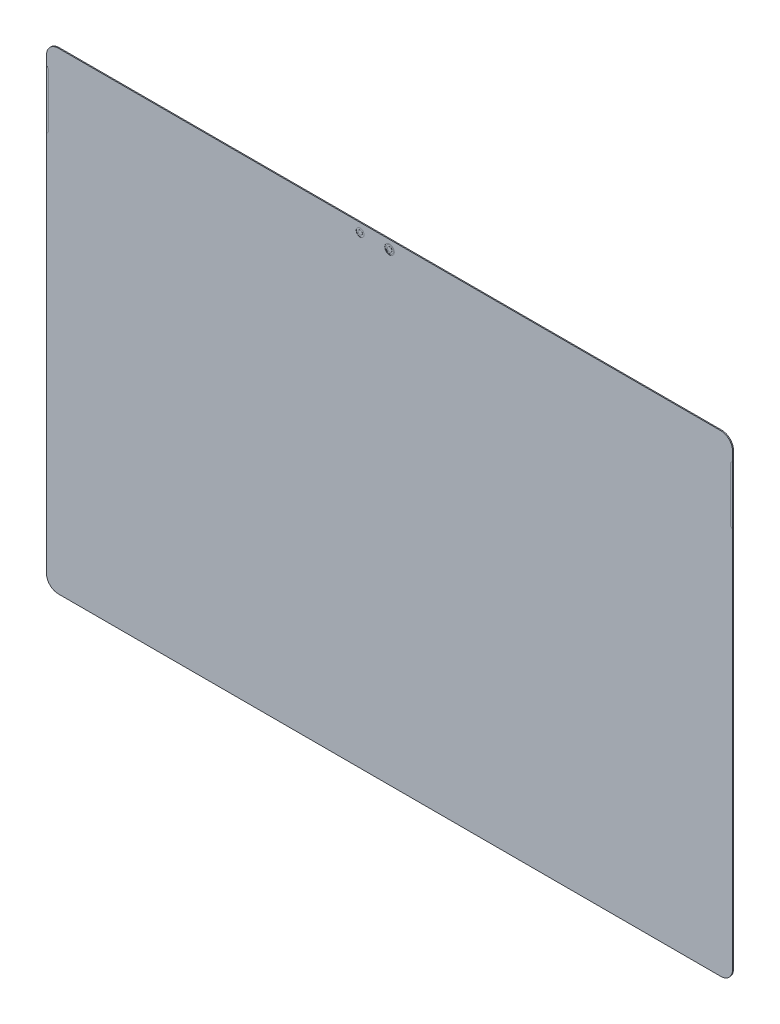
ISO-10303-21;
HEADER;
FILE_DESCRIPTION(('STEP AP214'),'2;1');
FILE_NAME('part.step','',(''),(''),'','','');
FILE_SCHEMA(('AUTOMOTIVE_DESIGN { 1 0 10303 214 1 1 1 1 }'));
ENDSEC;
DATA;
#1=APPLICATION_CONTEXT('core data for automotive mechanical design processes');
#2=APPLICATION_PROTOCOL_DEFINITION('international standard','automotive_design',2000,#1);
#3=PRODUCT_CONTEXT('',#1,'mechanical');
#4=PRODUCT('Part','Part','',(#3));
#5=PRODUCT_RELATED_PRODUCT_CATEGORY('part','',(#4));
#6=PRODUCT_DEFINITION_FORMATION('','',#4);
#7=PRODUCT_DEFINITION_CONTEXT('part definition',#1,'design');
#8=PRODUCT_DEFINITION('design','',#6,#7);
#9=PRODUCT_DEFINITION_SHAPE('','',#8);
#10=(LENGTH_UNIT() NAMED_UNIT(*) SI_UNIT(.MILLI.,.METRE.));
#11=(NAMED_UNIT(*) PLANE_ANGLE_UNIT() SI_UNIT($,.RADIAN.));
#12=(NAMED_UNIT(*) SI_UNIT($,.STERADIAN.) SOLID_ANGLE_UNIT());
#13=UNCERTAINTY_MEASURE_WITH_UNIT(LENGTH_MEASURE(1.E-05),#10,'distance_accuracy_value','');
#14=(GEOMETRIC_REPRESENTATION_CONTEXT(3) GLOBAL_UNCERTAINTY_ASSIGNED_CONTEXT((#13)) GLOBAL_UNIT_ASSIGNED_CONTEXT((#10,
#11,#12)) REPRESENTATION_CONTEXT('',''));
#15=CARTESIAN_POINT('',(0.,0.,0.));
#16=DIRECTION('',(0.,0.,1.));
#17=DIRECTION('',(1.,0.,0.));
#18=AXIS2_PLACEMENT_3D('',#15,#16,#17);
#19=CARTESIAN_POINT('',(-152.1,-103.1,0.45));
#20=DIRECTION('',(0.,0.,1.));
#21=DIRECTION('',(1.,0.,0.));
#22=AXIS2_PLACEMENT_3D('',#19,#20,#21);
#23=PLANE('',#22);
#24=CARTESIAN_POINT('',(0.,104.5,0.45));
#25=DIRECTION('',(0.,0.,1.));
#26=DIRECTION('',(1.,0.,0.));
#27=AXIS2_PLACEMENT_3D('',#24,#25,#26);
#28=CIRCLE('',#27,2.2);
#29=CARTESIAN_POINT('',(2.19999999999997,104.5,0.45));
#30=VERTEX_POINT('',#29);
#31=EDGE_CURVE('E271',#30,#30,#28,.T.);
#32=ORIENTED_EDGE('',*,*,#31,.F.);
#33=EDGE_LOOP('',(#32));
#34=FACE_BOUND('',#33,.T.);
#35=CARTESIAN_POINT('',(-13.5,104.5,0.45));
#36=DIRECTION('',(0.,0.,1.));
#37=DIRECTION('',(1.,0.,0.));
#38=AXIS2_PLACEMENT_3D('',#35,#36,#37);
#39=CIRCLE('',#38,1.79999999999999);
#40=CARTESIAN_POINT('',(-11.7,104.5,0.45));
#41=VERTEX_POINT('',#40);
#42=EDGE_CURVE('E264',#41,#41,#39,.T.);
#43=ORIENTED_EDGE('',*,*,#42,.F.);
#44=EDGE_LOOP('',(#43));
#45=FACE_BOUND('',#44,.T.);
#46=DIRECTION('',(0.,-1.,0.));
#47=VECTOR('',#46,1.);
#48=CARTESIAN_POINT('',(-157.5,103.1,0.45));
#49=LINE('',#48,#47);
#50=CARTESIAN_POINT('',(-157.5,103.1,0.45));
#51=VERTEX_POINT('',#50);
#52=CARTESIAN_POINT('',(-157.5,98.9448186316806,0.45));
#53=VERTEX_POINT('',#52);
#54=EDGE_CURVE('E297',#51,#53,#49,.T.);
#55=ORIENTED_EDGE('',*,*,#54,.T.);
#56=DIRECTION('',(-0.707106781186568,0.707106781186527,0.));
#57=VECTOR('',#56,1.);
#58=CARTESIAN_POINT('',(-156.792893218813,98.237711850494,0.45));
#59=LINE('',#58,#57);
#60=CARTESIAN_POINT('',(-156.792893218813,98.237711850494,0.45));
#61=VERTEX_POINT('',#60);
#62=EDGE_CURVE('E434',#61,#53,#59,.T.);
#63=ORIENTED_EDGE('',*,*,#62,.F.);
#64=CARTESIAN_POINT('',(-157.5,97.5306050693075,0.45));
#65=DIRECTION('',(0.,0.,1.));
#66=DIRECTION('',(1.,0.,0.));
#67=AXIS2_PLACEMENT_3D('',#64,#65,#66);
#68=CIRCLE('',#67,1.);
#69=CARTESIAN_POINT('',(-156.5,97.5306050693075,0.45));
#70=VERTEX_POINT('',#69);
#71=EDGE_CURVE('E198',#70,#61,#68,.T.);
#72=ORIENTED_EDGE('',*,*,#71,.F.);
#73=DIRECTION('',(0.,1.,0.));
#74=VECTOR('',#73,1.);
#75=CARTESIAN_POINT('',(-156.5,73.3590321940537,0.45));
#76=LINE('',#75,#74);
#77=CARTESIAN_POINT('',(-156.5,73.3590321940537,0.45));
#78=VERTEX_POINT('',#77);
#79=EDGE_CURVE('E194',#78,#70,#76,.T.);
#80=ORIENTED_EDGE('',*,*,#79,.F.);
#81=CARTESIAN_POINT('',(-157.5,73.3590321940537,0.45));
#82=DIRECTION('',(0.,0.,1.));
#83=DIRECTION('',(1.,0.,0.));
#84=AXIS2_PLACEMENT_3D('',#81,#82,#83);
#85=CIRCLE('',#84,1.);
#86=CARTESIAN_POINT('',(-156.792893218813,72.6519254128671,0.45));
#87=VERTEX_POINT('',#86);
#88=EDGE_CURVE('E438',#87,#78,#85,.T.);
#89=ORIENTED_EDGE('',*,*,#88,.F.);
#90=DIRECTION('',(0.707106781186554,0.707106781186541,0.));
#91=VECTOR('',#90,1.);
#92=CARTESIAN_POINT('',(-157.5,71.9448186316806,0.45));
#93=LINE('',#92,#91);
#94=CARTESIAN_POINT('',(-157.5,71.9448186316806,0.45));
#95=VERTEX_POINT('',#94);
#96=EDGE_CURVE('E436',#95,#87,#93,.T.);
#97=ORIENTED_EDGE('',*,*,#96,.F.);
#98=CARTESIAN_POINT('',(-157.5,-103.1,0.45));
#99=VERTEX_POINT('',#98);
#100=EDGE_CURVE('E296',#95,#99,#49,.T.);
#101=ORIENTED_EDGE('',*,*,#100,.T.);
#102=CARTESIAN_POINT('',(-152.1,-103.1,0.45));
#103=DIRECTION('',(0.,0.,1.));
#104=DIRECTION('',(1.,0.,0.));
#105=AXIS2_PLACEMENT_3D('',#102,#103,#104);
#106=CIRCLE('',#105,5.4);
#107=CARTESIAN_POINT('',(-152.1,-108.5,0.45));
#108=VERTEX_POINT('',#107);
#109=EDGE_CURVE('E279',#99,#108,#106,.T.);
#110=ORIENTED_EDGE('',*,*,#109,.T.);
#111=DIRECTION('',(1.,0.,0.));
#112=VECTOR('',#111,1.);
#113=CARTESIAN_POINT('',(-152.1,-108.5,0.45));
#114=LINE('',#113,#112);
#115=CARTESIAN_POINT('',(152.1,-108.5,0.45));
#116=VERTEX_POINT('',#115);
#117=EDGE_CURVE('E282',#108,#116,#114,.T.);
#118=ORIENTED_EDGE('',*,*,#117,.T.);
#119=CARTESIAN_POINT('',(152.1,-103.1,0.45));
#120=DIRECTION('',(0.,0.,1.));
#121=DIRECTION('',(1.,0.,0.));
#122=AXIS2_PLACEMENT_3D('',#119,#120,#121);
#123=CIRCLE('',#122,5.4);
#124=CARTESIAN_POINT('',(157.5,-103.1,0.45));
#125=VERTEX_POINT('',#124);
#126=EDGE_CURVE('E285',#116,#125,#123,.T.);
#127=ORIENTED_EDGE('',*,*,#126,.T.);
#128=DIRECTION('',(0.,1.,0.));
#129=VECTOR('',#128,1.);
#130=CARTESIAN_POINT('',(157.5,-103.1,0.45));
#131=LINE('',#130,#129);
#132=CARTESIAN_POINT('',(157.5,71.9448186316806,0.45));
#133=VERTEX_POINT('',#132);
#134=EDGE_CURVE('E288',#125,#133,#131,.T.);
#135=ORIENTED_EDGE('',*,*,#134,.T.);
#136=DIRECTION('',(0.707106781186554,-0.707106781186541,0.));
#137=VECTOR('',#136,1.);
#138=CARTESIAN_POINT('',(157.5,71.9448186316806,0.45));
#139=LINE('',#138,#137);
#140=CARTESIAN_POINT('',(156.792893218813,72.6519254128671,0.45));
#141=VERTEX_POINT('',#140);
#142=EDGE_CURVE('E61',#141,#133,#139,.T.);
#143=ORIENTED_EDGE('',*,*,#142,.F.);
#144=CARTESIAN_POINT('',(157.5,73.3590321940537,0.45));
#145=DIRECTION('',(0.,0.,1.));
#146=DIRECTION('',(-1.,0.,0.));
#147=AXIS2_PLACEMENT_3D('',#144,#145,#146);
#148=CIRCLE('',#147,1.);
#149=CARTESIAN_POINT('',(156.5,73.3590321940537,0.45));
#150=VERTEX_POINT('',#149);
#151=EDGE_CURVE('E228',#150,#141,#148,.T.);
#152=ORIENTED_EDGE('',*,*,#151,.F.);
#153=DIRECTION('',(0.,-1.,0.));
#154=VECTOR('',#153,1.);
#155=CARTESIAN_POINT('',(156.5,73.3590321940537,0.45));
#156=LINE('',#155,#154);
#157=CARTESIAN_POINT('',(156.5,97.5306050693075,0.45));
#158=VERTEX_POINT('',#157);
#159=EDGE_CURVE('E225',#158,#150,#156,.T.);
#160=ORIENTED_EDGE('',*,*,#159,.F.);
#161=CARTESIAN_POINT('',(157.5,97.5306050693075,0.45));
#162=DIRECTION('',(0.,0.,1.));
#163=DIRECTION('',(-1.,0.,0.));
#164=AXIS2_PLACEMENT_3D('',#161,#162,#163);
#165=CIRCLE('',#164,1.);
#166=CARTESIAN_POINT('',(156.792893218813,98.237711850494,0.45));
#167=VERTEX_POINT('',#166);
#168=EDGE_CURVE('E203',#167,#158,#165,.T.);
#169=ORIENTED_EDGE('',*,*,#168,.F.);
#170=DIRECTION('',(-0.707106781186568,-0.707106781186527,0.));
#171=VECTOR('',#170,1.);
#172=CARTESIAN_POINT('',(156.792893218813,98.237711850494,0.45));
#173=LINE('',#172,#171);
#174=CARTESIAN_POINT('',(157.5,98.9448186316805,0.45));
#175=VERTEX_POINT('',#174);
#176=EDGE_CURVE('E200',#175,#167,#173,.T.);
#177=ORIENTED_EDGE('',*,*,#176,.F.);
#178=CARTESIAN_POINT('',(157.5,103.1,0.45));
#179=VERTEX_POINT('',#178);
#180=EDGE_CURVE('E287',#175,#179,#131,.T.);
#181=ORIENTED_EDGE('',*,*,#180,.T.);
#182=CARTESIAN_POINT('',(152.1,103.1,0.45));
#183=DIRECTION('',(0.,0.,1.));
#184=DIRECTION('',(1.,0.,0.));
#185=AXIS2_PLACEMENT_3D('',#182,#183,#184);
#186=CIRCLE('',#185,5.39999999999999);
#187=CARTESIAN_POINT('',(152.1,108.5,0.45));
#188=VERTEX_POINT('',#187);
#189=EDGE_CURVE('E290',#179,#188,#186,.T.);
#190=ORIENTED_EDGE('',*,*,#189,.T.);
#191=DIRECTION('',(-1.,0.,0.));
#192=VECTOR('',#191,1.);
#193=CARTESIAN_POINT('',(152.1,108.5,0.45));
#194=LINE('',#193,#192);
#195=CARTESIAN_POINT('',(-152.1,108.5,0.45));
#196=VERTEX_POINT('',#195);
#197=EDGE_CURVE('E292',#188,#196,#194,.T.);
#198=ORIENTED_EDGE('',*,*,#197,.T.);
#199=CARTESIAN_POINT('',(-152.1,103.1,0.45));
#200=DIRECTION('',(0.,0.,1.));
#201=DIRECTION('',(1.,0.,0.));
#202=AXIS2_PLACEMENT_3D('',#199,#200,#201);
#203=CIRCLE('',#202,5.4);
#204=EDGE_CURVE('E294',#196,#51,#203,.T.);
#205=ORIENTED_EDGE('',*,*,#204,.T.);
#206=EDGE_LOOP('',(#55,#63,#72,#80,#89,#97,#101,#110,#118,#127,#135,#143,#152,#160,#169,#177,
#181,#190,#198,#205));
#207=FACE_BOUND('',#206,.T.);
#208=ADVANCED_FACE('F38',(#34,#45,#207),#23,.T.);
#209=CARTESIAN_POINT('',(-152.1,-103.1,0.45));
#210=DIRECTION('',(0.,0.,-1.));
#211=DIRECTION('',(-1.,0.,0.));
#212=AXIS2_PLACEMENT_3D('',#209,#210,#211);
#213=CYLINDRICAL_SURFACE('',#212,5.4);
#214=CARTESIAN_POINT('',(-152.1,-103.1,0.));
#215=DIRECTION('',(0.,0.,1.));
#216=DIRECTION('',(1.,0.,0.));
#217=AXIS2_PLACEMENT_3D('',#214,#215,#216);
#218=CIRCLE('',#217,5.4);
#219=CARTESIAN_POINT('',(-157.5,-103.1,0.));
#220=VERTEX_POINT('',#219);
#221=CARTESIAN_POINT('',(-152.1,-108.5,0.));
#222=VERTEX_POINT('',#221);
#223=EDGE_CURVE('E270',#220,#222,#218,.T.);
#224=ORIENTED_EDGE('',*,*,#223,.T.);
#225=DIRECTION('',(0.,0.,-1.));
#226=VECTOR('',#225,1.);
#227=CARTESIAN_POINT('',(-152.1,-108.5,0.45));
#228=LINE('',#227,#226);
#229=EDGE_CURVE('E11',#108,#222,#228,.T.);
#230=ORIENTED_EDGE('',*,*,#229,.F.);
#231=ORIENTED_EDGE('',*,*,#109,.F.);
#232=DIRECTION('',(0.,0.,-1.));
#233=VECTOR('',#232,1.);
#234=CARTESIAN_POINT('',(-157.5,-103.1,0.45));
#235=LINE('',#234,#233);
#236=EDGE_CURVE('E300',#99,#220,#235,.T.);
#237=ORIENTED_EDGE('',*,*,#236,.T.);
#238=EDGE_LOOP('',(#224,#230,#231,#237));
#239=FACE_BOUND('',#238,.T.);
#240=ADVANCED_FACE('F40',(#239),#213,.T.);
#241=CARTESIAN_POINT('',(-152.1,-108.5,0.45));
#242=DIRECTION('',(0.,1.,0.));
#243=DIRECTION('',(0.,0.,1.));
#244=AXIS2_PLACEMENT_3D('',#241,#242,#243);
#245=PLANE('',#244);
#246=DIRECTION('',(1.,0.,0.));
#247=VECTOR('',#246,1.);
#248=CARTESIAN_POINT('',(-152.1,-108.5,0.));
#249=LINE('',#248,#247);
#250=CARTESIAN_POINT('',(152.1,-108.5,0.));
#251=VERTEX_POINT('',#250);
#252=EDGE_CURVE('E303',#222,#251,#249,.T.);
#253=ORIENTED_EDGE('',*,*,#252,.T.);
#254=DIRECTION('',(0.,0.,-1.));
#255=VECTOR('',#254,1.);
#256=CARTESIAN_POINT('',(152.1,-108.5,0.45));
#257=LINE('',#256,#255);
#258=EDGE_CURVE('E46',#116,#251,#257,.T.);
#259=ORIENTED_EDGE('',*,*,#258,.F.);
#260=ORIENTED_EDGE('',*,*,#117,.F.);
#261=ORIENTED_EDGE('',*,*,#229,.T.);
#262=EDGE_LOOP('',(#253,#259,#260,#261));
#263=FACE_BOUND('',#262,.T.);
#264=ADVANCED_FACE('F395',(#263),#245,.F.);
#265=CARTESIAN_POINT('',(152.1,-103.1,0.45));
#266=DIRECTION('',(0.,0.,-1.));
#267=DIRECTION('',(-1.,0.,0.));
#268=AXIS2_PLACEMENT_3D('',#265,#266,#267);
#269=CYLINDRICAL_SURFACE('',#268,5.4);
#270=CARTESIAN_POINT('',(152.1,-103.1,0.));
#271=DIRECTION('',(0.,0.,1.));
#272=DIRECTION('',(1.,0.,0.));
#273=AXIS2_PLACEMENT_3D('',#270,#271,#272);
#274=CIRCLE('',#273,5.4);
#275=CARTESIAN_POINT('',(157.5,-103.1,0.));
#276=VERTEX_POINT('',#275);
#277=EDGE_CURVE('E305',#251,#276,#274,.T.);
#278=ORIENTED_EDGE('',*,*,#277,.T.);
#279=DIRECTION('',(0.,0.,-1.));
#280=VECTOR('',#279,1.);
#281=CARTESIAN_POINT('',(157.5,-103.1,0.45));
#282=LINE('',#281,#280);
#283=EDGE_CURVE('E330',#125,#276,#282,.T.);
#284=ORIENTED_EDGE('',*,*,#283,.F.);
#285=ORIENTED_EDGE('',*,*,#126,.F.);
#286=ORIENTED_EDGE('',*,*,#258,.T.);
#287=EDGE_LOOP('',(#278,#284,#285,#286));
#288=FACE_BOUND('',#287,.T.);
#289=ADVANCED_FACE('F337',(#288),#269,.T.);
#290=CARTESIAN_POINT('',(157.5,-103.1,0.45));
#291=DIRECTION('',(-1.,0.,0.));
#292=DIRECTION('',(0.,-1.,0.));
#293=AXIS2_PLACEMENT_3D('',#290,#291,#292);
#294=PLANE('',#293);
#295=DIRECTION('',(0.,1.,0.));
#296=VECTOR('',#295,1.);
#297=CARTESIAN_POINT('',(157.5,-103.1,0.));
#298=LINE('',#297,#296);
#299=CARTESIAN_POINT('',(157.5,103.1,0.));
#300=VERTEX_POINT('',#299);
#301=EDGE_CURVE('E307',#276,#300,#298,.T.);
#302=ORIENTED_EDGE('',*,*,#301,.T.);
#303=DIRECTION('',(0.,0.,-1.));
#304=VECTOR('',#303,1.);
#305=CARTESIAN_POINT('',(157.5,103.1,0.45));
#306=LINE('',#305,#304);
#307=EDGE_CURVE('E327',#179,#300,#306,.T.);
#308=ORIENTED_EDGE('',*,*,#307,.F.);
#309=ORIENTED_EDGE('',*,*,#180,.F.);
#310=DIRECTION('',(0.,0.,-1.));
#311=VECTOR('',#310,1.);
#312=CARTESIAN_POINT('',(157.5,98.9448186316806,0.46));
#313=LINE('',#312,#311);
#314=CARTESIAN_POINT('',(157.5,98.9448186316806,0.46));
#315=VERTEX_POINT('',#314);
#316=EDGE_CURVE('E245',#315,#175,#313,.T.);
#317=ORIENTED_EDGE('',*,*,#316,.F.);
#318=DIRECTION('',(0.,1.,0.));
#319=VECTOR('',#318,1.);
#320=CARTESIAN_POINT('',(157.5,98.9448186316806,0.46));
#321=LINE('',#320,#319);
#322=CARTESIAN_POINT('',(157.5,71.9448186316806,0.46));
#323=VERTEX_POINT('',#322);
#324=EDGE_CURVE('E209',#323,#315,#321,.T.);
#325=ORIENTED_EDGE('',*,*,#324,.F.);
#326=DIRECTION('',(0.,0.,-1.));
#327=VECTOR('',#326,1.);
#328=CARTESIAN_POINT('',(157.5,71.9448186316806,0.46));
#329=LINE('',#328,#327);
#330=EDGE_CURVE('E221',#323,#133,#329,.T.);
#331=ORIENTED_EDGE('',*,*,#330,.T.);
#332=ORIENTED_EDGE('',*,*,#134,.F.);
#333=ORIENTED_EDGE('',*,*,#283,.T.);
#334=EDGE_LOOP('',(#302,#308,#309,#317,#325,#331,#332,#333));
#335=FACE_BOUND('',#334,.T.);
#336=ADVANCED_FACE('F348',(#335),#294,.F.);
#337=CARTESIAN_POINT('',(152.1,103.1,0.45));
#338=DIRECTION('',(0.,0.,-1.));
#339=DIRECTION('',(-1.,0.,0.));
#340=AXIS2_PLACEMENT_3D('',#337,#338,#339);
#341=CYLINDRICAL_SURFACE('',#340,5.39999999999999);
#342=CARTESIAN_POINT('',(152.1,103.1,0.));
#343=DIRECTION('',(0.,0.,1.));
#344=DIRECTION('',(1.,0.,0.));
#345=AXIS2_PLACEMENT_3D('',#342,#343,#344);
#346=CIRCLE('',#345,5.39999999999999);
#347=CARTESIAN_POINT('',(152.1,108.5,0.));
#348=VERTEX_POINT('',#347);
#349=EDGE_CURVE('E309',#300,#348,#346,.T.);
#350=ORIENTED_EDGE('',*,*,#349,.T.);
#351=DIRECTION('',(0.,0.,-1.));
#352=VECTOR('',#351,1.);
#353=CARTESIAN_POINT('',(152.1,108.5,0.45));
#354=LINE('',#353,#352);
#355=EDGE_CURVE('E324',#188,#348,#354,.T.);
#356=ORIENTED_EDGE('',*,*,#355,.F.);
#357=ORIENTED_EDGE('',*,*,#189,.F.);
#358=ORIENTED_EDGE('',*,*,#307,.T.);
#359=EDGE_LOOP('',(#350,#356,#357,#358));
#360=FACE_BOUND('',#359,.T.);
#361=ADVANCED_FACE('F353',(#360),#341,.T.);
#362=CARTESIAN_POINT('',(152.1,108.5,0.45));
#363=DIRECTION('',(0.,-1.,0.));
#364=DIRECTION('',(1.,0.,0.));
#365=AXIS2_PLACEMENT_3D('',#362,#363,#364);
#366=PLANE('',#365);
#367=DIRECTION('',(-1.,0.,0.));
#368=VECTOR('',#367,1.);
#369=CARTESIAN_POINT('',(152.1,108.5,0.));
#370=LINE('',#369,#368);
#371=CARTESIAN_POINT('',(-152.1,108.5,0.));
#372=VERTEX_POINT('',#371);
#373=EDGE_CURVE('E311',#348,#372,#370,.T.);
#374=ORIENTED_EDGE('',*,*,#373,.T.);
#375=DIRECTION('',(0.,0.,-1.));
#376=VECTOR('',#375,1.);
#377=CARTESIAN_POINT('',(-152.1,108.5,0.45));
#378=LINE('',#377,#376);
#379=EDGE_CURVE('E321',#196,#372,#378,.T.);
#380=ORIENTED_EDGE('',*,*,#379,.F.);
#381=ORIENTED_EDGE('',*,*,#197,.F.);
#382=ORIENTED_EDGE('',*,*,#355,.T.);
#383=EDGE_LOOP('',(#374,#380,#381,#382));
#384=FACE_BOUND('',#383,.T.);
#385=ADVANCED_FACE('F412',(#384),#366,.F.);
#386=CARTESIAN_POINT('',(-152.1,103.1,0.45));
#387=DIRECTION('',(0.,0.,-1.));
#388=DIRECTION('',(-1.,0.,0.));
#389=AXIS2_PLACEMENT_3D('',#386,#387,#388);
#390=CYLINDRICAL_SURFACE('',#389,5.4);
#391=CARTESIAN_POINT('',(-152.1,103.1,0.));
#392=DIRECTION('',(0.,0.,1.));
#393=DIRECTION('',(1.,0.,0.));
#394=AXIS2_PLACEMENT_3D('',#391,#392,#393);
#395=CIRCLE('',#394,5.4);
#396=CARTESIAN_POINT('',(-157.5,103.1,0.));
#397=VERTEX_POINT('',#396);
#398=EDGE_CURVE('E313',#372,#397,#395,.T.);
#399=ORIENTED_EDGE('',*,*,#398,.T.);
#400=DIRECTION('',(0.,0.,-1.));
#401=VECTOR('',#400,1.);
#402=CARTESIAN_POINT('',(-157.5,103.1,0.45));
#403=LINE('',#402,#401);
#404=EDGE_CURVE('E318',#51,#397,#403,.T.);
#405=ORIENTED_EDGE('',*,*,#404,.F.);
#406=ORIENTED_EDGE('',*,*,#204,.F.);
#407=ORIENTED_EDGE('',*,*,#379,.T.);
#408=EDGE_LOOP('',(#399,#405,#406,#407));
#409=FACE_BOUND('',#408,.T.);
#410=ADVANCED_FACE('F408',(#409),#390,.T.);
#411=CARTESIAN_POINT('',(-157.5,103.1,0.45));
#412=DIRECTION('',(1.,0.,0.));
#413=DIRECTION('',(0.,1.,0.));
#414=AXIS2_PLACEMENT_3D('',#411,#412,#413);
#415=PLANE('',#414);
#416=DIRECTION('',(0.,-1.,0.));
#417=VECTOR('',#416,1.);
#418=CARTESIAN_POINT('',(-157.5,103.1,0.));
#419=LINE('',#418,#417);
#420=EDGE_CURVE('E283',#397,#220,#419,.T.);
#421=ORIENTED_EDGE('',*,*,#420,.T.);
#422=ORIENTED_EDGE('',*,*,#236,.F.);
#423=ORIENTED_EDGE('',*,*,#100,.F.);
#424=DIRECTION('',(0.,0.,-1.));
#425=VECTOR('',#424,1.);
#426=CARTESIAN_POINT('',(-157.5,71.9448186316806,0.46));
#427=LINE('',#426,#425);
#428=CARTESIAN_POINT('',(-157.5,71.9448186316806,0.46));
#429=VERTEX_POINT('',#428);
#430=EDGE_CURVE('E205',#429,#95,#427,.T.);
#431=ORIENTED_EDGE('',*,*,#430,.F.);
#432=DIRECTION('',(0.,-1.,0.));
#433=VECTOR('',#432,1.);
#434=CARTESIAN_POINT('',(-157.5,98.9448186316806,0.46));
#435=LINE('',#434,#433);
#436=CARTESIAN_POINT('',(-157.5,98.9448186316806,0.46));
#437=VERTEX_POINT('',#436);
#438=EDGE_CURVE('E185',#437,#429,#435,.T.);
#439=ORIENTED_EDGE('',*,*,#438,.F.);
#440=DIRECTION('',(0.,0.,-1.));
#441=VECTOR('',#440,1.);
#442=CARTESIAN_POINT('',(-157.5,98.9448186316806,0.46));
#443=LINE('',#442,#441);
#444=EDGE_CURVE('E182',#437,#53,#443,.T.);
#445=ORIENTED_EDGE('',*,*,#444,.T.);
#446=ORIENTED_EDGE('',*,*,#54,.F.);
#447=ORIENTED_EDGE('',*,*,#404,.T.);
#448=EDGE_LOOP('',(#421,#422,#423,#431,#439,#445,#446,#447));
#449=FACE_BOUND('',#448,.T.);
#450=ADVANCED_FACE('F405',(#449),#415,.F.);
#451=CARTESIAN_POINT('',(-152.1,-103.1,0.));
#452=DIRECTION('',(0.,0.,1.));
#453=DIRECTION('',(1.,0.,0.));
#454=AXIS2_PLACEMENT_3D('',#451,#452,#453);
#455=PLANE('',#454);
#456=ORIENTED_EDGE('',*,*,#223,.F.);
#457=ORIENTED_EDGE('',*,*,#420,.F.);
#458=ORIENTED_EDGE('',*,*,#398,.F.);
#459=ORIENTED_EDGE('',*,*,#373,.F.);
#460=ORIENTED_EDGE('',*,*,#349,.F.);
#461=ORIENTED_EDGE('',*,*,#301,.F.);
#462=ORIENTED_EDGE('',*,*,#277,.F.);
#463=ORIENTED_EDGE('',*,*,#252,.F.);
#464=EDGE_LOOP('',(#456,#457,#458,#459,#460,#461,#462,#463));
#465=FACE_BOUND('',#464,.T.);
#466=ADVANCED_FACE('F343',(#465),#455,.F.);
#467=CARTESIAN_POINT('',(-13.5,104.5,0.35));
#468=DIRECTION('',(0.,0.,1.));
#469=DIRECTION('',(1.,0.,0.));
#470=AXIS2_PLACEMENT_3D('',#467,#468,#469);
#471=CYLINDRICAL_SURFACE('',#470,1.79999999999999);
#472=CARTESIAN_POINT('',(-13.5,104.5,0.35));
#473=DIRECTION('',(0.,0.,1.));
#474=DIRECTION('',(1.,0.,0.));
#475=AXIS2_PLACEMENT_3D('',#472,#473,#474);
#476=CIRCLE('',#475,1.79999999999999);
#477=CARTESIAN_POINT('',(-11.7,104.5,0.35));
#478=VERTEX_POINT('',#477);
#479=EDGE_CURVE('E274',#478,#478,#476,.T.);
#480=ORIENTED_EDGE('',*,*,#479,.F.);
#481=EDGE_LOOP('',(#480));
#482=FACE_BOUND('',#481,.T.);
#483=ORIENTED_EDGE('',*,*,#42,.T.);
#484=EDGE_LOOP('',(#483));
#485=FACE_BOUND('',#484,.T.);
#486=ADVANCED_FACE('F401',(#482,#485),#471,.F.);
#487=CARTESIAN_POINT('',(-13.5,104.5,0.35));
#488=DIRECTION('',(0.,0.,1.));
#489=DIRECTION('',(1.,0.,0.));
#490=AXIS2_PLACEMENT_3D('',#487,#488,#489);
#491=PLANE('',#490);
#492=CARTESIAN_POINT('',(-13.5,104.5,0.35));
#493=DIRECTION('',(0.,0.,1.));
#494=DIRECTION('',(1.,0.,0.));
#495=AXIS2_PLACEMENT_3D('',#492,#493,#494);
#496=CIRCLE('',#495,0.950130494881064);
#497=CARTESIAN_POINT('',(-12.549869505119,104.5,0.35));
#498=VERTEX_POINT('',#497);
#499=EDGE_CURVE('E258',#498,#498,#496,.T.);
#500=ORIENTED_EDGE('',*,*,#499,.F.);
#501=EDGE_LOOP('',(#500));
#502=FACE_BOUND('',#501,.T.);
#503=ORIENTED_EDGE('',*,*,#479,.T.);
#504=EDGE_LOOP('',(#503));
#505=FACE_BOUND('',#504,.T.);
#506=ADVANCED_FACE('F649',(#502,#505),#491,.T.);
#507=CARTESIAN_POINT('',(0.,104.5,0.35));
#508=DIRECTION('',(0.,0.,1.));
#509=DIRECTION('',(1.,0.,0.));
#510=AXIS2_PLACEMENT_3D('',#507,#508,#509);
#511=CYLINDRICAL_SURFACE('',#510,2.2);
#512=CARTESIAN_POINT('',(0.,104.5,0.35));
#513=DIRECTION('',(0.,0.,1.));
#514=DIRECTION('',(1.,0.,0.));
#515=AXIS2_PLACEMENT_3D('',#512,#513,#514);
#516=CIRCLE('',#515,2.2);
#517=CARTESIAN_POINT('',(2.19999999999997,104.5,0.35));
#518=VERTEX_POINT('',#517);
#519=EDGE_CURVE('E267',#518,#518,#516,.T.);
#520=ORIENTED_EDGE('',*,*,#519,.F.);
#521=EDGE_LOOP('',(#520));
#522=FACE_BOUND('',#521,.T.);
#523=ORIENTED_EDGE('',*,*,#31,.T.);
#524=EDGE_LOOP('',(#523));
#525=FACE_BOUND('',#524,.T.);
#526=ADVANCED_FACE('F640',(#522,#525),#511,.F.);
#527=CARTESIAN_POINT('',(0.,104.5,0.35));
#528=DIRECTION('',(0.,0.,1.));
#529=DIRECTION('',(1.,0.,0.));
#530=AXIS2_PLACEMENT_3D('',#527,#528,#529);
#531=PLANE('',#530);
#532=CARTESIAN_POINT('',(0.,104.5,0.35));
#533=DIRECTION('',(0.,0.,1.));
#534=DIRECTION('',(1.,0.,0.));
#535=AXIS2_PLACEMENT_3D('',#532,#533,#534);
#536=CIRCLE('',#535,1.77541381374077);
#537=CARTESIAN_POINT('',(1.77541381374074,104.5,0.35));
#538=VERTEX_POINT('',#537);
#539=EDGE_CURVE('E252',#538,#538,#536,.T.);
#540=ORIENTED_EDGE('',*,*,#539,.F.);
#541=EDGE_LOOP('',(#540));
#542=FACE_BOUND('',#541,.T.);
#543=ORIENTED_EDGE('',*,*,#519,.T.);
#544=EDGE_LOOP('',(#543));
#545=FACE_BOUND('',#544,.T.);
#546=ADVANCED_FACE('F631',(#542,#545),#531,.T.);
#547=CARTESIAN_POINT('',(-13.5,104.5,0.4));
#548=DIRECTION('',(0.,0.,-1.));
#549=DIRECTION('',(-1.,0.,0.));
#550=AXIS2_PLACEMENT_3D('',#547,#548,#549);
#551=CYLINDRICAL_SURFACE('',#550,0.950130494881064);
#552=CARTESIAN_POINT('',(-13.5,104.5,0.4));
#553=DIRECTION('',(0.,0.,1.));
#554=DIRECTION('',(1.,0.,0.));
#555=AXIS2_PLACEMENT_3D('',#552,#553,#554);
#556=CIRCLE('',#555,0.950130494881064);
#557=CARTESIAN_POINT('',(-12.549869505119,104.5,0.4));
#558=VERTEX_POINT('',#557);
#559=EDGE_CURVE('E261',#558,#558,#556,.T.);
#560=ORIENTED_EDGE('',*,*,#559,.F.);
#561=EDGE_LOOP('',(#560));
#562=FACE_BOUND('',#561,.T.);
#563=ORIENTED_EDGE('',*,*,#499,.T.);
#564=EDGE_LOOP('',(#563));
#565=FACE_BOUND('',#564,.T.);
#566=ADVANCED_FACE('F621',(#562,#565),#551,.T.);
#567=CARTESIAN_POINT('',(-13.5,104.5,0.4));
#568=DIRECTION('',(0.,0.,1.));
#569=DIRECTION('',(1.,0.,0.));
#570=AXIS2_PLACEMENT_3D('',#567,#568,#569);
#571=PLANE('',#570);
#572=ORIENTED_EDGE('',*,*,#559,.T.);
#573=EDGE_LOOP('',(#572));
#574=FACE_BOUND('',#573,.T.);
#575=ADVANCED_FACE('F611',(#574),#571,.T.);
#576=CARTESIAN_POINT('',(0.,104.5,0.3));
#577=DIRECTION('',(0.,0.,1.));
#578=DIRECTION('',(1.,0.,0.));
#579=AXIS2_PLACEMENT_3D('',#576,#577,#578);
#580=CYLINDRICAL_SURFACE('',#579,1.77541381374077);
#581=CARTESIAN_POINT('',(0.,104.5,0.3));
#582=DIRECTION('',(0.,0.,1.));
#583=DIRECTION('',(1.,0.,0.));
#584=AXIS2_PLACEMENT_3D('',#581,#582,#583);
#585=CIRCLE('',#584,1.77541381374077);
#586=CARTESIAN_POINT('',(1.77541381374074,104.5,0.3));
#587=VERTEX_POINT('',#586);
#588=EDGE_CURVE('E255',#587,#587,#585,.T.);
#589=ORIENTED_EDGE('',*,*,#588,.F.);
#590=EDGE_LOOP('',(#589));
#591=FACE_BOUND('',#590,.T.);
#592=ORIENTED_EDGE('',*,*,#539,.T.);
#593=EDGE_LOOP('',(#592));
#594=FACE_BOUND('',#593,.T.);
#595=ADVANCED_FACE('F602',(#591,#594),#580,.F.);
#596=CARTESIAN_POINT('',(0.,104.5,0.3));
#597=DIRECTION('',(0.,0.,1.));
#598=DIRECTION('',(1.,0.,0.));
#599=AXIS2_PLACEMENT_3D('',#596,#597,#598);
#600=PLANE('',#599);
#601=CARTESIAN_POINT('',(0.,104.5,0.3));
#602=DIRECTION('',(0.,0.,1.));
#603=DIRECTION('',(1.,0.,0.));
#604=AXIS2_PLACEMENT_3D('',#601,#602,#603);
#605=CIRCLE('',#604,1.05635072951413);
#606=CARTESIAN_POINT('',(1.0563507295141,104.5,0.3));
#607=VERTEX_POINT('',#606);
#608=EDGE_CURVE('E248',#607,#607,#605,.T.);
#609=ORIENTED_EDGE('',*,*,#608,.F.);
#610=EDGE_LOOP('',(#609));
#611=FACE_BOUND('',#610,.T.);
#612=ORIENTED_EDGE('',*,*,#588,.T.);
#613=EDGE_LOOP('',(#612));
#614=FACE_BOUND('',#613,.T.);
#615=ADVANCED_FACE('F593',(#611,#614),#600,.T.);
#616=CARTESIAN_POINT('',(0.,104.5,0.38));
#617=DIRECTION('',(0.,0.,-1.));
#618=DIRECTION('',(-1.,0.,0.));
#619=AXIS2_PLACEMENT_3D('',#616,#617,#618);
#620=CYLINDRICAL_SURFACE('',#619,1.05635072951413);
#621=CARTESIAN_POINT('',(0.,104.5,0.38));
#622=DIRECTION('',(0.,0.,1.));
#623=DIRECTION('',(1.,0.,0.));
#624=AXIS2_PLACEMENT_3D('',#621,#622,#623);
#625=CIRCLE('',#624,1.05635072951413);
#626=CARTESIAN_POINT('',(1.0563507295141,104.5,0.38));
#627=VERTEX_POINT('',#626);
#628=EDGE_CURVE('E249',#627,#627,#625,.T.);
#629=ORIENTED_EDGE('',*,*,#628,.F.);
#630=EDGE_LOOP('',(#629));
#631=FACE_BOUND('',#630,.T.);
#632=ORIENTED_EDGE('',*,*,#608,.T.);
#633=EDGE_LOOP('',(#632));
#634=FACE_BOUND('',#633,.T.);
#635=ADVANCED_FACE('F583',(#631,#634),#620,.T.);
#636=CARTESIAN_POINT('',(0.,104.5,0.38));
#637=DIRECTION('',(0.,0.,1.));
#638=DIRECTION('',(1.,0.,0.));
#639=AXIS2_PLACEMENT_3D('',#636,#637,#638);
#640=PLANE('',#639);
#641=ORIENTED_EDGE('',*,*,#628,.T.);
#642=EDGE_LOOP('',(#641));
#643=FACE_BOUND('',#642,.T.);
#644=ADVANCED_FACE('F387',(#643),#640,.T.);
#645=CARTESIAN_POINT('',(156.792893218813,98.237711850494,0.46));
#646=DIRECTION('',(0.707106781186527,-0.707106781186568,0.));
#647=DIRECTION('',(0.707106781186568,0.707106781186527,0.));
#648=AXIS2_PLACEMENT_3D('',#645,#646,#647);
#649=PLANE('',#648);
#650=ORIENTED_EDGE('',*,*,#176,.T.);
#651=DIRECTION('',(0.,0.,-1.));
#652=VECTOR('',#651,1.);
#653=CARTESIAN_POINT('',(156.792893218813,98.237711850494,0.46));
#654=LINE('',#653,#652);
#655=CARTESIAN_POINT('',(156.792893218813,98.237711850494,0.46));
#656=VERTEX_POINT('',#655);
#657=EDGE_CURVE('E242',#656,#167,#654,.T.);
#658=ORIENTED_EDGE('',*,*,#657,.F.);
#659=DIRECTION('',(-0.707106781186568,-0.707106781186527,0.));
#660=VECTOR('',#659,1.);
#661=CARTESIAN_POINT('',(156.792893218813,98.237711850494,0.46));
#662=LINE('',#661,#660);
#663=EDGE_CURVE('E212',#315,#656,#662,.T.);
#664=ORIENTED_EDGE('',*,*,#663,.F.);
#665=ORIENTED_EDGE('',*,*,#316,.T.);
#666=EDGE_LOOP('',(#650,#658,#664,#665));
#667=FACE_BOUND('',#666,.T.);
#668=ADVANCED_FACE('F360',(#667),#649,.F.);
#669=CARTESIAN_POINT('',(157.5,97.5306050693075,0.46));
#670=DIRECTION('',(0.,0.,-1.));
#671=DIRECTION('',(-1.,0.,0.));
#672=AXIS2_PLACEMENT_3D('',#669,#670,#671);
#673=CYLINDRICAL_SURFACE('',#672,1.);
#674=ORIENTED_EDGE('',*,*,#168,.T.);
#675=DIRECTION('',(0.,0.,-1.));
#676=VECTOR('',#675,1.);
#677=CARTESIAN_POINT('',(156.5,97.5306050693075,0.46));
#678=LINE('',#677,#676);
#679=CARTESIAN_POINT('',(156.5,97.5306050693075,0.46));
#680=VERTEX_POINT('',#679);
#681=EDGE_CURVE('E239',#680,#158,#678,.T.);
#682=ORIENTED_EDGE('',*,*,#681,.F.);
#683=CARTESIAN_POINT('',(157.5,97.5306050693075,0.46));
#684=DIRECTION('',(0.,0.,1.));
#685=DIRECTION('',(-1.,0.,0.));
#686=AXIS2_PLACEMENT_3D('',#683,#684,#685);
#687=CIRCLE('',#686,1.);
#688=EDGE_CURVE('E214',#656,#680,#687,.T.);
#689=ORIENTED_EDGE('',*,*,#688,.F.);
#690=ORIENTED_EDGE('',*,*,#657,.T.);
#691=EDGE_LOOP('',(#674,#682,#689,#690));
#692=FACE_BOUND('',#691,.T.);
#693=ADVANCED_FACE('F379',(#692),#673,.T.);
#694=CARTESIAN_POINT('',(156.5,73.3590321940537,0.46));
#695=DIRECTION('',(1.,0.,0.));
#696=DIRECTION('',(0.,0.,-1.));
#697=AXIS2_PLACEMENT_3D('',#694,#695,#696);
#698=PLANE('',#697);
#699=ORIENTED_EDGE('',*,*,#159,.T.);
#700=DIRECTION('',(0.,0.,-1.));
#701=VECTOR('',#700,1.);
#702=CARTESIAN_POINT('',(156.5,73.3590321940537,0.46));
#703=LINE('',#702,#701);
#704=CARTESIAN_POINT('',(156.5,73.3590321940537,0.46));
#705=VERTEX_POINT('',#704);
#706=EDGE_CURVE('E236',#705,#150,#703,.T.);
#707=ORIENTED_EDGE('',*,*,#706,.F.);
#708=DIRECTION('',(0.,-1.,0.));
#709=VECTOR('',#708,1.);
#710=CARTESIAN_POINT('',(156.5,73.3590321940537,0.46));
#711=LINE('',#710,#709);
#712=EDGE_CURVE('E216',#680,#705,#711,.T.);
#713=ORIENTED_EDGE('',*,*,#712,.F.);
#714=ORIENTED_EDGE('',*,*,#681,.T.);
#715=EDGE_LOOP('',(#699,#707,#713,#714));
#716=FACE_BOUND('',#715,.T.);
#717=ADVANCED_FACE('F375',(#716),#698,.F.);
#718=CARTESIAN_POINT('',(157.5,73.3590321940537,0.46));
#719=DIRECTION('',(0.,0.,-1.));
#720=DIRECTION('',(-1.,0.,0.));
#721=AXIS2_PLACEMENT_3D('',#718,#719,#720);
#722=CYLINDRICAL_SURFACE('',#721,1.);
#723=ORIENTED_EDGE('',*,*,#151,.T.);
#724=DIRECTION('',(0.,0.,-1.));
#725=VECTOR('',#724,1.);
#726=CARTESIAN_POINT('',(156.792893218813,72.6519254128671,0.46));
#727=LINE('',#726,#725);
#728=CARTESIAN_POINT('',(156.792893218813,72.6519254128671,0.46));
#729=VERTEX_POINT('',#728);
#730=EDGE_CURVE('E233',#729,#141,#727,.T.);
#731=ORIENTED_EDGE('',*,*,#730,.F.);
#732=CARTESIAN_POINT('',(157.5,73.3590321940537,0.46));
#733=DIRECTION('',(0.,0.,1.));
#734=DIRECTION('',(-1.,0.,0.));
#735=AXIS2_PLACEMENT_3D('',#732,#733,#734);
#736=CIRCLE('',#735,1.);
#737=EDGE_CURVE('E218',#705,#729,#736,.T.);
#738=ORIENTED_EDGE('',*,*,#737,.F.);
#739=ORIENTED_EDGE('',*,*,#706,.T.);
#740=EDGE_LOOP('',(#723,#731,#738,#739));
#741=FACE_BOUND('',#740,.T.);
#742=ADVANCED_FACE('F372',(#741),#722,.T.);
#743=CARTESIAN_POINT('',(157.5,71.9448186316806,0.46));
#744=DIRECTION('',(0.70710678118654,0.707106781186554,0.));
#745=DIRECTION('',(-0.707106781186554,0.707106781186541,0.));
#746=AXIS2_PLACEMENT_3D('',#743,#744,#745);
#747=PLANE('',#746);
#748=ORIENTED_EDGE('',*,*,#142,.T.);
#749=ORIENTED_EDGE('',*,*,#330,.F.);
#750=DIRECTION('',(0.707106781186554,-0.707106781186541,0.));
#751=VECTOR('',#750,1.);
#752=CARTESIAN_POINT('',(157.5,71.9448186316806,0.46));
#753=LINE('',#752,#751);
#754=EDGE_CURVE('E220',#729,#323,#753,.T.);
#755=ORIENTED_EDGE('',*,*,#754,.F.);
#756=ORIENTED_EDGE('',*,*,#730,.T.);
#757=EDGE_LOOP('',(#748,#749,#755,#756));
#758=FACE_BOUND('',#757,.T.);
#759=ADVANCED_FACE('F368',(#758),#747,.F.);
#760=CARTESIAN_POINT('',(157.5,73.3590321940537,0.46));
#761=DIRECTION('',(0.,0.,-1.));
#762=DIRECTION('',(-1.,0.,0.));
#763=AXIS2_PLACEMENT_3D('',#760,#761,#762);
#764=PLANE('',#763);
#765=ORIENTED_EDGE('',*,*,#324,.T.);
#766=ORIENTED_EDGE('',*,*,#663,.T.);
#767=ORIENTED_EDGE('',*,*,#688,.T.);
#768=ORIENTED_EDGE('',*,*,#712,.T.);
#769=ORIENTED_EDGE('',*,*,#737,.T.);
#770=ORIENTED_EDGE('',*,*,#754,.T.);
#771=EDGE_LOOP('',(#765,#766,#767,#768,#769,#770));
#772=FACE_BOUND('',#771,.T.);
#773=ADVANCED_FACE('F364',(#772),#764,.F.);
#774=CARTESIAN_POINT('',(-157.5,97.5306050693075,0.46));
#775=DIRECTION('',(0.,0.,-1.));
#776=DIRECTION('',(-1.,0.,0.));
#777=AXIS2_PLACEMENT_3D('',#774,#775,#776);
#778=CYLINDRICAL_SURFACE('',#777,1.);
#779=ORIENTED_EDGE('',*,*,#71,.T.);
#780=DIRECTION('',(0.,0.,-1.));
#781=VECTOR('',#780,1.);
#782=CARTESIAN_POINT('',(-156.792893218813,98.237711850494,0.46));
#783=LINE('',#782,#781);
#784=CARTESIAN_POINT('',(-156.792893218813,98.237711850494,0.46));
#785=VERTEX_POINT('',#784);
#786=EDGE_CURVE('E179',#785,#61,#783,.T.);
#787=ORIENTED_EDGE('',*,*,#786,.F.);
#788=CARTESIAN_POINT('',(-157.5,97.5306050693075,0.46));
#789=DIRECTION('',(0.,0.,1.));
#790=DIRECTION('',(1.,0.,0.));
#791=AXIS2_PLACEMENT_3D('',#788,#789,#790);
#792=CIRCLE('',#791,1.);
#793=CARTESIAN_POINT('',(-156.5,97.5306050693075,0.46));
#794=VERTEX_POINT('',#793);
#795=EDGE_CURVE('E186',#794,#785,#792,.T.);
#796=ORIENTED_EDGE('',*,*,#795,.F.);
#797=DIRECTION('',(0.,0.,-1.));
#798=VECTOR('',#797,1.);
#799=CARTESIAN_POINT('',(-156.5,97.5306050693075,0.46));
#800=LINE('',#799,#798);
#801=EDGE_CURVE('E445',#794,#70,#800,.T.);
#802=ORIENTED_EDGE('',*,*,#801,.T.);
#803=EDGE_LOOP('',(#779,#787,#796,#802));
#804=FACE_BOUND('',#803,.T.);
#805=ADVANCED_FACE('F196',(#804),#778,.T.);
#806=CARTESIAN_POINT('',(-156.792893218813,98.237711850494,0.46));
#807=DIRECTION('',(-0.707106781186527,-0.707106781186568,0.));
#808=DIRECTION('',(0.707106781186568,-0.707106781186527,0.));
#809=AXIS2_PLACEMENT_3D('',#806,#807,#808);
#810=PLANE('',#809);
#811=ORIENTED_EDGE('',*,*,#62,.T.);
#812=ORIENTED_EDGE('',*,*,#444,.F.);
#813=DIRECTION('',(-0.707106781186568,0.707106781186527,0.));
#814=VECTOR('',#813,1.);
#815=CARTESIAN_POINT('',(-156.792893218813,98.237711850494,0.46));
#816=LINE('',#815,#814);
#817=EDGE_CURVE('E175',#785,#437,#816,.T.);
#818=ORIENTED_EDGE('',*,*,#817,.F.);
#819=ORIENTED_EDGE('',*,*,#786,.T.);
#820=EDGE_LOOP('',(#811,#812,#818,#819));
#821=FACE_BOUND('',#820,.T.);
#822=ADVANCED_FACE('F177',(#821),#810,.F.);
#823=CARTESIAN_POINT('',(-157.5,71.9448186316806,0.46));
#824=DIRECTION('',(-0.70710678118654,0.707106781186554,0.));
#825=DIRECTION('',(-0.707106781186554,-0.707106781186541,0.));
#826=AXIS2_PLACEMENT_3D('',#823,#824,#825);
#827=PLANE('',#826);
#828=ORIENTED_EDGE('',*,*,#96,.T.);
#829=DIRECTION('',(0.,0.,-1.));
#830=VECTOR('',#829,1.);
#831=CARTESIAN_POINT('',(-156.792893218813,72.6519254128671,0.46));
#832=LINE('',#831,#830);
#833=CARTESIAN_POINT('',(-156.792893218813,72.6519254128671,0.46));
#834=VERTEX_POINT('',#833);
#835=EDGE_CURVE('E448',#834,#87,#832,.T.);
#836=ORIENTED_EDGE('',*,*,#835,.F.);
#837=DIRECTION('',(0.707106781186554,0.707106781186541,0.));
#838=VECTOR('',#837,1.);
#839=CARTESIAN_POINT('',(-157.5,71.9448186316806,0.46));
#840=LINE('',#839,#838);
#841=EDGE_CURVE('E456',#429,#834,#840,.T.);
#842=ORIENTED_EDGE('',*,*,#841,.F.);
#843=ORIENTED_EDGE('',*,*,#430,.T.);
#844=EDGE_LOOP('',(#828,#836,#842,#843));
#845=FACE_BOUND('',#844,.T.);
#846=ADVANCED_FACE('F454',(#845),#827,.F.);
#847=CARTESIAN_POINT('',(-157.5,73.3590321940537,0.46));
#848=DIRECTION('',(0.,0.,-1.));
#849=DIRECTION('',(-1.,0.,0.));
#850=AXIS2_PLACEMENT_3D('',#847,#848,#849);
#851=CYLINDRICAL_SURFACE('',#850,1.);
#852=ORIENTED_EDGE('',*,*,#88,.T.);
#853=DIRECTION('',(0.,0.,-1.));
#854=VECTOR('',#853,1.);
#855=CARTESIAN_POINT('',(-156.5,73.3590321940537,0.46));
#856=LINE('',#855,#854);
#857=CARTESIAN_POINT('',(-156.5,73.3590321940537,0.46));
#858=VERTEX_POINT('',#857);
#859=EDGE_CURVE('E53',#858,#78,#856,.T.);
#860=ORIENTED_EDGE('',*,*,#859,.F.);
#861=CARTESIAN_POINT('',(-157.5,73.3590321940537,0.46));
#862=DIRECTION('',(0.,0.,1.));
#863=DIRECTION('',(1.,0.,0.));
#864=AXIS2_PLACEMENT_3D('',#861,#862,#863);
#865=CIRCLE('',#864,1.);
#866=EDGE_CURVE('E461',#834,#858,#865,.T.);
#867=ORIENTED_EDGE('',*,*,#866,.F.);
#868=ORIENTED_EDGE('',*,*,#835,.T.);
#869=EDGE_LOOP('',(#852,#860,#867,#868));
#870=FACE_BOUND('',#869,.T.);
#871=ADVANCED_FACE('F459',(#870),#851,.T.);
#872=CARTESIAN_POINT('',(-156.5,73.3590321940537,0.46));
#873=DIRECTION('',(-1.,0.,0.));
#874=DIRECTION('',(0.,0.,1.));
#875=AXIS2_PLACEMENT_3D('',#872,#873,#874);
#876=PLANE('',#875);
#877=ORIENTED_EDGE('',*,*,#79,.T.);
#878=ORIENTED_EDGE('',*,*,#801,.F.);
#879=DIRECTION('',(0.,1.,0.));
#880=VECTOR('',#879,1.);
#881=CARTESIAN_POINT('',(-156.5,73.3590321940537,0.46));
#882=LINE('',#881,#880);
#883=EDGE_CURVE('E190',#858,#794,#882,.T.);
#884=ORIENTED_EDGE('',*,*,#883,.F.);
#885=ORIENTED_EDGE('',*,*,#859,.T.);
#886=EDGE_LOOP('',(#877,#878,#884,#885));
#887=FACE_BOUND('',#886,.T.);
#888=ADVANCED_FACE('F465',(#887),#876,.F.);
#889=CARTESIAN_POINT('',(-157.5,97.5306050693075,0.46));
#890=DIRECTION('',(0.,0.,1.));
#891=DIRECTION('',(1.,0.,0.));
#892=AXIS2_PLACEMENT_3D('',#889,#890,#891);
#893=PLANE('',#892);
#894=ORIENTED_EDGE('',*,*,#795,.T.);
#895=ORIENTED_EDGE('',*,*,#817,.T.);
#896=ORIENTED_EDGE('',*,*,#438,.T.);
#897=ORIENTED_EDGE('',*,*,#841,.T.);
#898=ORIENTED_EDGE('',*,*,#866,.T.);
#899=ORIENTED_EDGE('',*,*,#883,.T.);
#900=EDGE_LOOP('',(#894,#895,#896,#897,#898,#899));
#901=FACE_BOUND('',#900,.T.);
#902=ADVANCED_FACE('F189',(#901),#893,.T.);
#903=CLOSED_SHELL('',(#208,#240,#264,#289,#336,#361,#385,#410,#450,#466,#486,#506,#526,#546,
#566,#575,#595,#615,#635,#644,#668,#693,#717,#742,#759,#773,#805,#822,#846,#871,#888,#902));
#904=MANIFOLD_SOLID_BREP('B2',#903);
#905=ADVANCED_BREP_SHAPE_REPRESENTATION('',(#18,#904),#14);
#906=SHAPE_DEFINITION_REPRESENTATION(#9,#905);
ENDSEC;
END-ISO-10303-21;
